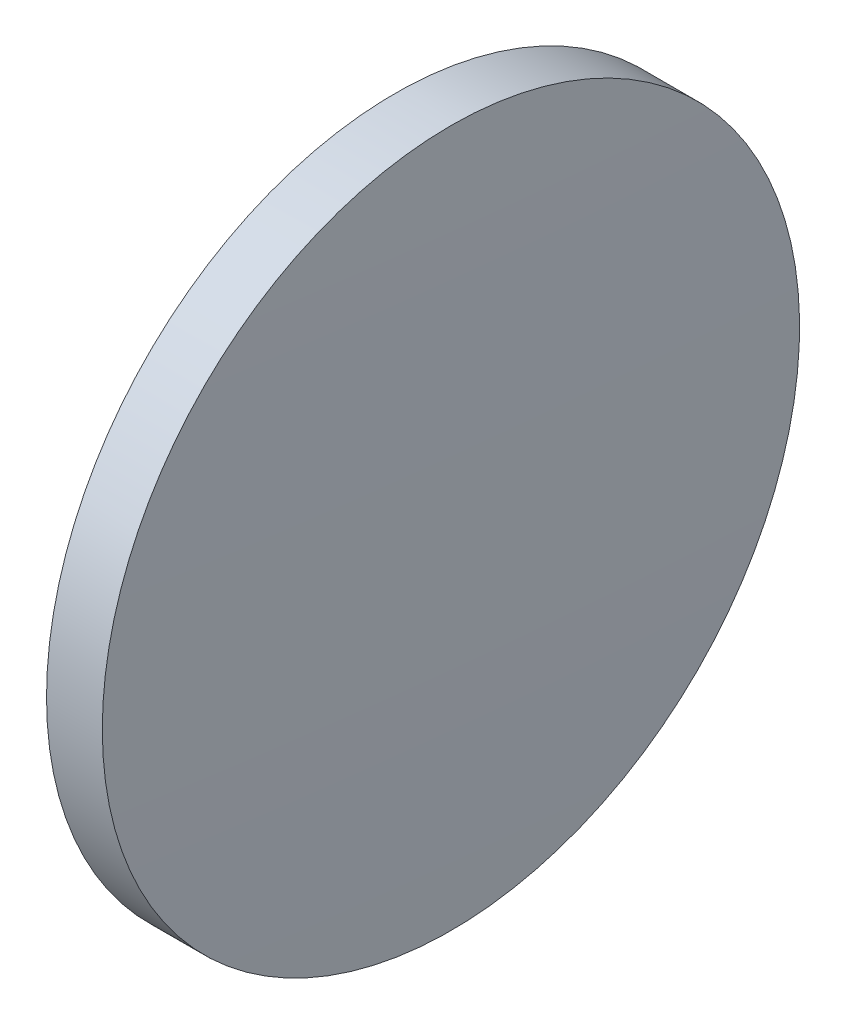
ISO-10303-21;
HEADER;
FILE_DESCRIPTION(('STEP AP214'),'2;1');
FILE_NAME('part.step','',(''),(''),'','','');
FILE_SCHEMA(('AUTOMOTIVE_DESIGN { 1 0 10303 214 1 1 1 1 }'));
ENDSEC;
DATA;
#1=APPLICATION_CONTEXT('core data for automotive mechanical design processes');
#2=APPLICATION_PROTOCOL_DEFINITION('international standard','automotive_design',2000,#1);
#3=PRODUCT_CONTEXT('',#1,'mechanical');
#4=PRODUCT('Part','Part','',(#3));
#5=PRODUCT_RELATED_PRODUCT_CATEGORY('part','',(#4));
#6=PRODUCT_DEFINITION_FORMATION('','',#4);
#7=PRODUCT_DEFINITION_CONTEXT('part definition',#1,'design');
#8=PRODUCT_DEFINITION('design','',#6,#7);
#9=PRODUCT_DEFINITION_SHAPE('','',#8);
#10=(LENGTH_UNIT() NAMED_UNIT(*) SI_UNIT(.MILLI.,.METRE.));
#11=(NAMED_UNIT(*) PLANE_ANGLE_UNIT() SI_UNIT($,.RADIAN.));
#12=(NAMED_UNIT(*) SI_UNIT($,.STERADIAN.) SOLID_ANGLE_UNIT());
#13=UNCERTAINTY_MEASURE_WITH_UNIT(LENGTH_MEASURE(1.E-05),#10,'distance_accuracy_value','');
#14=(GEOMETRIC_REPRESENTATION_CONTEXT(3) GLOBAL_UNCERTAINTY_ASSIGNED_CONTEXT((#13)) GLOBAL_UNIT_ASSIGNED_CONTEXT((#10,
#11,#12)) REPRESENTATION_CONTEXT('',''));
#15=CARTESIAN_POINT('',(0.,0.,0.));
#16=DIRECTION('',(0.,0.,1.));
#17=DIRECTION('',(1.,0.,0.));
#18=AXIS2_PLACEMENT_3D('',#15,#16,#17);
#19=CARTESIAN_POINT('',(-92.1806051125664,122.387071526686,0.));
#20=DIRECTION('',(-1.,0.,0.));
#21=DIRECTION('',(0.,1.,0.));
#22=AXIS2_PLACEMENT_3D('',#19,#20,#21);
#23=SPHERICAL_SURFACE('',#22,520.908333333363);
#24=CARTESIAN_POINT('',(428.577728220797,122.387071526689,0.));
#25=DIRECTION('',(-1.,0.,0.));
#26=DIRECTION('',(0.,0.,1.));
#27=AXIS2_PLACEMENT_3D('',#24,#25,#26);
#28=CIRCLE('',#27,12.5);
#29=CARTESIAN_POINT('',(428.577728220797,122.387071526689,12.5));
#30=VERTEX_POINT('',#29);
#31=EDGE_CURVE('E10',#30,#30,#28,.T.);
#32=ORIENTED_EDGE('',*,*,#31,.F.);
#33=EDGE_LOOP('',(#32));
#34=FACE_BOUND('',#33,.T.);
#35=ADVANCED_FACE('F35',(#34),#23,.T.);
#36=CARTESIAN_POINT('',(421.835696978907,122.387071526689,0.));
#37=DIRECTION('',(-1.,0.,0.));
#38=DIRECTION('',(0.,0.,1.));
#39=AXIS2_PLACEMENT_3D('',#36,#37,#38);
#40=CYLINDRICAL_SURFACE('',#39,12.5);
#41=CARTESIAN_POINT('',(426.577728220797,122.387071526689,0.));
#42=DIRECTION('',(-1.,0.,0.));
#43=DIRECTION('',(0.,0.,1.));
#44=AXIS2_PLACEMENT_3D('',#41,#42,#43);
#45=CIRCLE('',#44,12.5);
#46=CARTESIAN_POINT('',(426.577728220797,122.387071526689,12.5));
#47=VERTEX_POINT('',#46);
#48=EDGE_CURVE('E41',#47,#47,#45,.T.);
#49=ORIENTED_EDGE('',*,*,#48,.F.);
#50=EDGE_LOOP('',(#49));
#51=FACE_BOUND('',#50,.T.);
#52=ORIENTED_EDGE('',*,*,#31,.T.);
#53=EDGE_LOOP('',(#52));
#54=FACE_BOUND('',#53,.T.);
#55=ADVANCED_FACE('F49',(#51,#54),#40,.T.);
#56=CARTESIAN_POINT('',(426.577728220797,122.387071526689,0.));
#57=DIRECTION('',(1.,0.,0.));
#58=DIRECTION('',(0.,0.,-1.));
#59=AXIS2_PLACEMENT_3D('',#56,#57,#58);
#60=PLANE('',#59);
#61=ORIENTED_EDGE('',*,*,#48,.T.);
#62=EDGE_LOOP('',(#61));
#63=FACE_BOUND('',#62,.T.);
#64=ADVANCED_FACE('F47',(#63),#60,.F.);
#65=CLOSED_SHELL('',(#35,#55,#64));
#66=MANIFOLD_SOLID_BREP('B2',#65);
#67=ADVANCED_BREP_SHAPE_REPRESENTATION('',(#18,#66),#14);
#68=SHAPE_DEFINITION_REPRESENTATION(#9,#67);
ENDSEC;
END-ISO-10303-21;
